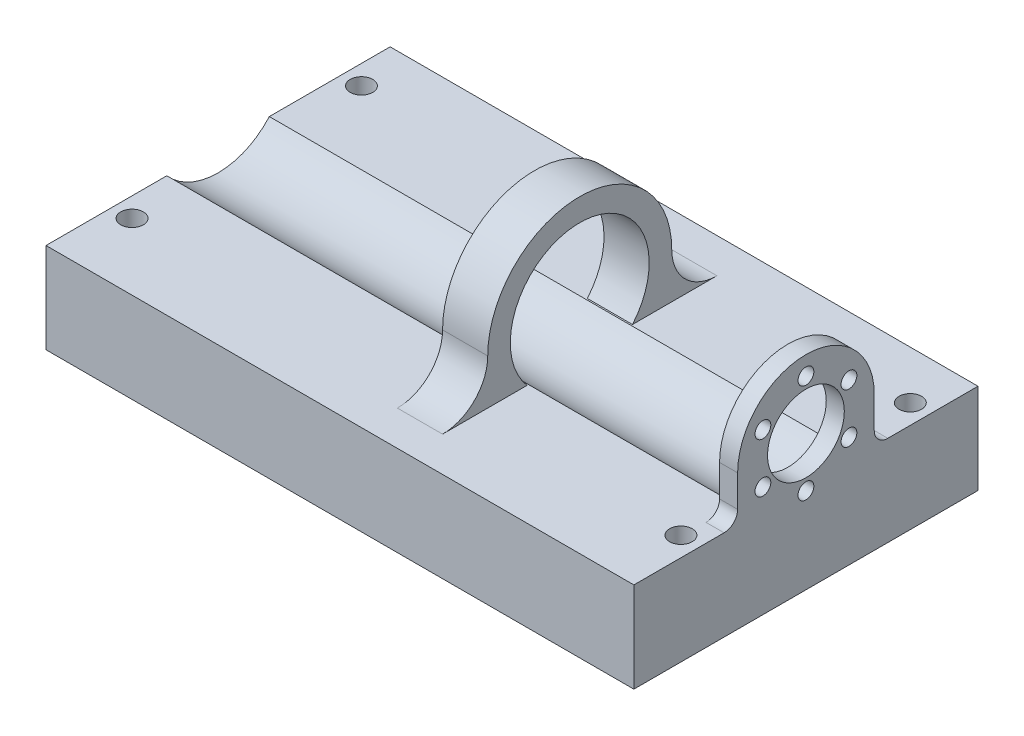
ISO-10303-21;
HEADER;
FILE_DESCRIPTION(('STEP AP214'),'2;1');
FILE_NAME('part.step','',(''),(''),'','','');
FILE_SCHEMA(('AUTOMOTIVE_DESIGN { 1 0 10303 214 1 1 1 1 }'));
ENDSEC;
DATA;
#1=APPLICATION_CONTEXT('core data for automotive mechanical design processes');
#2=APPLICATION_PROTOCOL_DEFINITION('international standard','automotive_design',2000,#1);
#3=PRODUCT_CONTEXT('',#1,'mechanical');
#4=PRODUCT('Part','Part','',(#3));
#5=PRODUCT_RELATED_PRODUCT_CATEGORY('part','',(#4));
#6=PRODUCT_DEFINITION_FORMATION('','',#4);
#7=PRODUCT_DEFINITION_CONTEXT('part definition',#1,'design');
#8=PRODUCT_DEFINITION('design','',#6,#7);
#9=PRODUCT_DEFINITION_SHAPE('','',#8);
#10=(LENGTH_UNIT() NAMED_UNIT(*) SI_UNIT(.MILLI.,.METRE.));
#11=(NAMED_UNIT(*) PLANE_ANGLE_UNIT() SI_UNIT($,.RADIAN.));
#12=(NAMED_UNIT(*) SI_UNIT($,.STERADIAN.) SOLID_ANGLE_UNIT());
#13=UNCERTAINTY_MEASURE_WITH_UNIT(LENGTH_MEASURE(1.E-05),#10,'distance_accuracy_value','');
#14=(GEOMETRIC_REPRESENTATION_CONTEXT(3) GLOBAL_UNCERTAINTY_ASSIGNED_CONTEXT((#13)) GLOBAL_UNIT_ASSIGNED_CONTEXT((#10,
#11,#12)) REPRESENTATION_CONTEXT('',''));
#15=CARTESIAN_POINT('',(0.,0.,0.));
#16=DIRECTION('',(0.,0.,1.));
#17=DIRECTION('',(1.,0.,0.));
#18=AXIS2_PLACEMENT_3D('',#15,#16,#17);
#19=CARTESIAN_POINT('',(0.,20.,0.));
#20=DIRECTION('',(0.,-1.,0.));
#21=DIRECTION('',(0.,0.,-1.));
#22=AXIS2_PLACEMENT_3D('',#19,#20,#21);
#23=PLANE('',#22);
#24=DIRECTION('',(0.,0.,-1.));
#25=VECTOR('',#24,1.);
#26=CARTESIAN_POINT('',(61.0875,20.,0.));
#27=LINE('',#26,#25);
#28=CARTESIAN_POINT('',(61.0875,20.,-11.3474942167864));
#29=VERTEX_POINT('',#28);
#30=CARTESIAN_POINT('',(61.0875,20.,-18.125));
#31=VERTEX_POINT('',#30);
#32=EDGE_CURVE('E237',#29,#31,#27,.T.);
#33=ORIENTED_EDGE('',*,*,#32,.T.);
#34=DIRECTION('',(1.,0.,0.));
#35=VECTOR('',#34,1.);
#36=CARTESIAN_POINT('',(65.0875,20.,-18.125));
#37=LINE('',#36,#35);
#38=CARTESIAN_POINT('',(65.0875,20.,-18.125));
#39=VERTEX_POINT('',#38);
#40=EDGE_CURVE('E211',#31,#39,#37,.T.);
#41=ORIENTED_EDGE('',*,*,#40,.T.);
#42=DIRECTION('',(0.,0.,-1.));
#43=VECTOR('',#42,1.);
#44=CARTESIAN_POINT('',(65.0875,20.,38.1));
#45=LINE('',#44,#43);
#46=CARTESIAN_POINT('',(65.0875,20.,-38.1));
#47=VERTEX_POINT('',#46);
#48=EDGE_CURVE('E246',#39,#47,#45,.T.);
#49=ORIENTED_EDGE('',*,*,#48,.T.);
#50=DIRECTION('',(-1.,0.,0.));
#51=VECTOR('',#50,1.);
#52=CARTESIAN_POINT('',(-65.0875,20.,-38.1));
#53=LINE('',#52,#51);
#54=CARTESIAN_POINT('',(-65.0875,20.,-38.1));
#55=VERTEX_POINT('',#54);
#56=EDGE_CURVE('E263',#47,#55,#53,.T.);
#57=ORIENTED_EDGE('',*,*,#56,.T.);
#58=DIRECTION('',(0.,0.,1.));
#59=VECTOR('',#58,1.);
#60=CARTESIAN_POINT('',(-65.0875,20.,38.1));
#61=LINE('',#60,#59);
#62=CARTESIAN_POINT('',(-65.0875,20.,-11.3474942167864));
#63=VERTEX_POINT('',#62);
#64=EDGE_CURVE('E273',#55,#63,#61,.T.);
#65=ORIENTED_EDGE('',*,*,#64,.T.);
#66=DIRECTION('',(1.,0.,0.));
#67=VECTOR('',#66,1.);
#68=CARTESIAN_POINT('',(-65.0875,20.,-11.3474942167864));
#69=LINE('',#68,#67);
#70=EDGE_CURVE('E305',#63,#29,#69,.T.);
#71=ORIENTED_EDGE('',*,*,#70,.T.);
#72=EDGE_LOOP('',(#33,#41,#49,#57,#65,#71));
#73=FACE_BOUND('',#72,.T.);
#74=CARTESIAN_POINT('',(-60.7695,20.,-27.432));
#75=DIRECTION('',(0.,-1.,0.));
#76=DIRECTION('',(0.,0.,-1.));
#77=AXIS2_PLACEMENT_3D('',#74,#75,#76);
#78=CIRCLE('',#77,2.50000000000001);
#79=CARTESIAN_POINT('',(-60.7695,20.,-29.932));
#80=VERTEX_POINT('',#79);
#81=EDGE_CURVE('E380',#80,#80,#78,.F.);
#82=ORIENTED_EDGE('',*,*,#81,.F.);
#83=EDGE_LOOP('',(#82));
#84=FACE_BOUND('',#83,.T.);
#85=CARTESIAN_POINT('',(60.7695,20.,-27.432));
#86=DIRECTION('',(0.,-1.,0.));
#87=DIRECTION('',(0.,0.,-1.));
#88=AXIS2_PLACEMENT_3D('',#85,#86,#87);
#89=CIRCLE('',#88,2.50000000000001);
#90=CARTESIAN_POINT('',(60.7695,20.,-29.932));
#91=VERTEX_POINT('',#90);
#92=EDGE_CURVE('E396',#91,#91,#89,.T.);
#93=ORIENTED_EDGE('',*,*,#92,.T.);
#94=EDGE_LOOP('',(#93));
#95=FACE_BOUND('',#94,.T.);
#96=DIRECTION('',(1.,0.,0.));
#97=VECTOR('',#96,1.);
#98=CARTESIAN_POINT('',(15.,20.,-30.375));
#99=LINE('',#98,#97);
#100=CARTESIAN_POINT('',(5.,20.,-30.375));
#101=VERTEX_POINT('',#100);
#102=CARTESIAN_POINT('',(15.,20.,-30.375));
#103=VERTEX_POINT('',#102);
#104=EDGE_CURVE('E196',#101,#103,#99,.T.);
#105=ORIENTED_EDGE('',*,*,#104,.T.);
#106=DIRECTION('',(0.,0.,-1.));
#107=VECTOR('',#106,1.);
#108=CARTESIAN_POINT('',(15.,20.,0.));
#109=LINE('',#108,#107);
#110=CARTESIAN_POINT('',(15.,20.,-11.6786396896214));
#111=VERTEX_POINT('',#110);
#112=EDGE_CURVE('E356',#111,#103,#109,.T.);
#113=ORIENTED_EDGE('',*,*,#112,.F.);
#114=DIRECTION('',(-1.,0.,0.));
#115=VECTOR('',#114,1.);
#116=CARTESIAN_POINT('',(15.,20.,-11.6786396896214));
#117=LINE('',#116,#115);
#118=CARTESIAN_POINT('',(5.,20.,-11.6786396896214));
#119=VERTEX_POINT('',#118);
#120=EDGE_CURVE('E372',#111,#119,#117,.T.);
#121=ORIENTED_EDGE('',*,*,#120,.T.);
#122=DIRECTION('',(0.,0.,-1.));
#123=VECTOR('',#122,1.);
#124=CARTESIAN_POINT('',(5.,20.,0.));
#125=LINE('',#124,#123);
#126=EDGE_CURVE('E181',#119,#101,#125,.T.);
#127=ORIENTED_EDGE('',*,*,#126,.T.);
#128=EDGE_LOOP('',(#105,#113,#121,#127));
#129=FACE_BOUND('',#128,.T.);
#130=ADVANCED_FACE('F41',(#73,#84,#95,#129),#23,.F.);
#131=CARTESIAN_POINT('',(65.0875,20.,38.1));
#132=VERTEX_POINT('',#131);
#133=CARTESIAN_POINT('',(65.0875,20.,18.125));
#134=VERTEX_POINT('',#133);
#135=EDGE_CURVE('E258',#132,#134,#45,.T.);
#136=ORIENTED_EDGE('',*,*,#135,.T.);
#137=DIRECTION('',(1.,0.,0.));
#138=VECTOR('',#137,1.);
#139=CARTESIAN_POINT('',(0.,20.,18.125));
#140=LINE('',#139,#138);
#141=CARTESIAN_POINT('',(61.0875,20.,18.125));
#142=VERTEX_POINT('',#141);
#143=EDGE_CURVE('E222',#134,#142,#140,.F.);
#144=ORIENTED_EDGE('',*,*,#143,.T.);
#145=DIRECTION('',(0.,0.,-1.));
#146=VECTOR('',#145,1.);
#147=CARTESIAN_POINT('',(61.0875,20.,0.));
#148=LINE('',#147,#146);
#149=CARTESIAN_POINT('',(61.0875,20.,11.3474942167864));
#150=VERTEX_POINT('',#149);
#151=EDGE_CURVE('E56',#142,#150,#148,.T.);
#152=ORIENTED_EDGE('',*,*,#151,.T.);
#153=DIRECTION('',(1.,0.,0.));
#154=VECTOR('',#153,1.);
#155=CARTESIAN_POINT('',(-65.0875,20.,11.3474942167864));
#156=LINE('',#155,#154);
#157=CARTESIAN_POINT('',(-65.0875,20.,11.3474942167864));
#158=VERTEX_POINT('',#157);
#159=EDGE_CURVE('E302',#150,#158,#156,.F.);
#160=ORIENTED_EDGE('',*,*,#159,.T.);
#161=CARTESIAN_POINT('',(-65.0875,20.,38.1));
#162=VERTEX_POINT('',#161);
#163=EDGE_CURVE('E272',#158,#162,#61,.T.);
#164=ORIENTED_EDGE('',*,*,#163,.T.);
#165=DIRECTION('',(1.,0.,0.));
#166=VECTOR('',#165,1.);
#167=CARTESIAN_POINT('',(-65.0875,20.,38.1));
#168=LINE('',#167,#166);
#169=EDGE_CURVE('E277',#162,#132,#168,.T.);
#170=ORIENTED_EDGE('',*,*,#169,.T.);
#171=EDGE_LOOP('',(#136,#144,#152,#160,#164,#170));
#172=FACE_BOUND('',#171,.T.);
#173=CARTESIAN_POINT('',(60.7695,20.,23.368));
#174=DIRECTION('',(0.,-1.,0.));
#175=DIRECTION('',(0.,0.,-1.));
#176=AXIS2_PLACEMENT_3D('',#173,#174,#175);
#177=CIRCLE('',#176,2.50000000000001);
#178=CARTESIAN_POINT('',(60.7695,20.,20.868));
#179=VERTEX_POINT('',#178);
#180=EDGE_CURVE('E403',#179,#179,#177,.T.);
#181=ORIENTED_EDGE('',*,*,#180,.T.);
#182=EDGE_LOOP('',(#181));
#183=FACE_BOUND('',#182,.T.);
#184=CARTESIAN_POINT('',(-60.7695,20.,23.368));
#185=DIRECTION('',(0.,-1.,0.));
#186=DIRECTION('',(0.,0.,-1.));
#187=AXIS2_PLACEMENT_3D('',#184,#185,#186);
#188=CIRCLE('',#187,2.50000000000001);
#189=CARTESIAN_POINT('',(-60.7695,20.,20.868));
#190=VERTEX_POINT('',#189);
#191=EDGE_CURVE('E387',#190,#190,#188,.F.);
#192=ORIENTED_EDGE('',*,*,#191,.F.);
#193=EDGE_LOOP('',(#192));
#194=FACE_BOUND('',#193,.T.);
#195=DIRECTION('',(0.,0.,1.));
#196=VECTOR('',#195,1.);
#197=CARTESIAN_POINT('',(15.,20.,0.));
#198=LINE('',#197,#196);
#199=CARTESIAN_POINT('',(15.,20.,11.6786396896214));
#200=VERTEX_POINT('',#199);
#201=CARTESIAN_POINT('',(15.,20.,30.375));
#202=VERTEX_POINT('',#201);
#203=EDGE_CURVE('E322',#200,#202,#198,.T.);
#204=ORIENTED_EDGE('',*,*,#203,.T.);
#205=DIRECTION('',(1.,0.,0.));
#206=VECTOR('',#205,1.);
#207=CARTESIAN_POINT('',(0.,20.,30.375));
#208=LINE('',#207,#206);
#209=CARTESIAN_POINT('',(5.,20.,30.375));
#210=VERTEX_POINT('',#209);
#211=EDGE_CURVE('E205',#202,#210,#208,.F.);
#212=ORIENTED_EDGE('',*,*,#211,.T.);
#213=DIRECTION('',(0.,0.,1.));
#214=VECTOR('',#213,1.);
#215=CARTESIAN_POINT('',(5.,20.,0.));
#216=LINE('',#215,#214);
#217=CARTESIAN_POINT('',(5.,20.,11.6786396896214));
#218=VERTEX_POINT('',#217);
#219=EDGE_CURVE('E180',#218,#210,#216,.T.);
#220=ORIENTED_EDGE('',*,*,#219,.F.);
#221=DIRECTION('',(-1.,0.,0.));
#222=VECTOR('',#221,1.);
#223=CARTESIAN_POINT('',(15.,20.,11.6786396896214));
#224=LINE('',#223,#222);
#225=EDGE_CURVE('E363',#200,#218,#224,.T.);
#226=ORIENTED_EDGE('',*,*,#225,.F.);
#227=EDGE_LOOP('',(#204,#212,#220,#226));
#228=FACE_BOUND('',#227,.T.);
#229=ADVANCED_FACE('F319',(#172,#183,#194,#228),#23,.F.);
#230=CARTESIAN_POINT('',(15.,30.,0.));
#231=DIRECTION('',(-1.,0.,0.));
#232=DIRECTION('',(0.,0.,1.));
#233=AXIS2_PLACEMENT_3D('',#230,#231,#232);
#234=CYLINDRICAL_SURFACE('',#233,20.375);
#235=CARTESIAN_POINT('',(15.,30.,0.));
#236=DIRECTION('',(1.,0.,0.));
#237=DIRECTION('',(0.,0.,-1.));
#238=AXIS2_PLACEMENT_3D('',#235,#236,#237);
#239=CIRCLE('',#238,20.375);
#240=CARTESIAN_POINT('',(15.,30.,-20.375));
#241=VERTEX_POINT('',#240);
#242=CARTESIAN_POINT('',(15.,30.0000000000014,20.375));
#243=VERTEX_POINT('',#242);
#244=EDGE_CURVE('E188',#241,#243,#239,.T.);
#245=ORIENTED_EDGE('',*,*,#244,.F.);
#246=DIRECTION('',(1.,0.,0.));
#247=VECTOR('',#246,1.);
#248=CARTESIAN_POINT('',(-5.33823373993176,30.,-20.375));
#249=LINE('',#248,#247);
#250=CARTESIAN_POINT('',(5.,30.,-20.375));
#251=VERTEX_POINT('',#250);
#252=EDGE_CURVE('E185',#251,#241,#249,.T.);
#253=ORIENTED_EDGE('',*,*,#252,.F.);
#254=CARTESIAN_POINT('',(5.,30.,0.));
#255=DIRECTION('',(1.,0.,0.));
#256=DIRECTION('',(0.,0.,-1.));
#257=AXIS2_PLACEMENT_3D('',#254,#255,#256);
#258=CIRCLE('',#257,20.375);
#259=CARTESIAN_POINT('',(5.,30.0000000000014,20.375));
#260=VERTEX_POINT('',#259);
#261=EDGE_CURVE('E166',#251,#260,#258,.T.);
#262=ORIENTED_EDGE('',*,*,#261,.T.);
#263=DIRECTION('',(1.,0.,0.));
#264=VECTOR('',#263,1.);
#265=CARTESIAN_POINT('',(-5.33823373993176,29.9999999999999,20.375));
#266=LINE('',#265,#264);
#267=EDGE_CURVE('E192',#260,#243,#266,.T.);
#268=ORIENTED_EDGE('',*,*,#267,.T.);
#269=EDGE_LOOP('',(#245,#253,#262,#268));
#270=FACE_BOUND('',#269,.T.);
#271=ADVANCED_FACE('F186',(#270),#234,.T.);
#272=CARTESIAN_POINT('',(61.0875,30.,0.));
#273=DIRECTION('',(1.,0.,0.));
#274=DIRECTION('',(0.,0.,-1.));
#275=AXIS2_PLACEMENT_3D('',#272,#273,#274);
#276=CYLINDRICAL_SURFACE('',#275,15.125);
#277=CARTESIAN_POINT('',(65.0875,30.,0.));
#278=DIRECTION('',(1.,0.,0.));
#279=DIRECTION('',(0.,0.,-1.));
#280=AXIS2_PLACEMENT_3D('',#277,#278,#279);
#281=CIRCLE('',#280,15.125);
#282=CARTESIAN_POINT('',(65.0875,30.,-15.125));
#283=VERTEX_POINT('',#282);
#284=CARTESIAN_POINT('',(65.0875,30.,15.125));
#285=VERTEX_POINT('',#284);
#286=EDGE_CURVE('E454',#283,#285,#281,.T.);
#287=ORIENTED_EDGE('',*,*,#286,.F.);
#288=DIRECTION('',(1.,0.,0.));
#289=VECTOR('',#288,1.);
#290=CARTESIAN_POINT('',(50.3978063681781,30.,-15.125));
#291=LINE('',#290,#289);
#292=CARTESIAN_POINT('',(61.0875,30.,-15.125));
#293=VERTEX_POINT('',#292);
#294=EDGE_CURVE('E329',#293,#283,#291,.T.);
#295=ORIENTED_EDGE('',*,*,#294,.F.);
#296=CARTESIAN_POINT('',(61.0875,30.,0.));
#297=DIRECTION('',(1.,0.,0.));
#298=DIRECTION('',(0.,0.,-1.));
#299=AXIS2_PLACEMENT_3D('',#296,#297,#298);
#300=CIRCLE('',#299,15.125);
#301=CARTESIAN_POINT('',(61.0875,30.,15.125));
#302=VERTEX_POINT('',#301);
#303=EDGE_CURVE('E460',#293,#302,#300,.T.);
#304=ORIENTED_EDGE('',*,*,#303,.T.);
#305=DIRECTION('',(1.,0.,0.));
#306=VECTOR('',#305,1.);
#307=CARTESIAN_POINT('',(50.3978063681781,30.,15.125));
#308=LINE('',#307,#306);
#309=EDGE_CURVE('E343',#302,#285,#308,.T.);
#310=ORIENTED_EDGE('',*,*,#309,.T.);
#311=EDGE_LOOP('',(#287,#295,#304,#310));
#312=FACE_BOUND('',#311,.T.);
#313=ADVANCED_FACE('F467',(#312),#276,.T.);
#314=CARTESIAN_POINT('',(-65.0875,30.,0.));
#315=DIRECTION('',(1.,0.,0.));
#316=DIRECTION('',(0.,0.,-1.));
#317=AXIS2_PLACEMENT_3D('',#314,#315,#316);
#318=CYLINDRICAL_SURFACE('',#317,15.125);
#319=EDGE_CURVE('E458',#150,#29,#300,.T.);
#320=ORIENTED_EDGE('',*,*,#319,.T.);
#321=ORIENTED_EDGE('',*,*,#70,.F.);
#322=CARTESIAN_POINT('',(-65.0875,30.,0.));
#323=DIRECTION('',(1.,0.,0.));
#324=DIRECTION('',(0.,0.,-1.));
#325=AXIS2_PLACEMENT_3D('',#322,#323,#324);
#326=CIRCLE('',#325,15.125);
#327=EDGE_CURVE('E268',#158,#63,#326,.T.);
#328=ORIENTED_EDGE('',*,*,#327,.F.);
#329=ORIENTED_EDGE('',*,*,#159,.F.);
#330=EDGE_LOOP('',(#320,#321,#328,#329));
#331=FACE_BOUND('',#330,.T.);
#332=ADVANCED_FACE('F499',(#331),#318,.F.);
#333=CARTESIAN_POINT('',(65.0875,20.,38.1));
#334=DIRECTION('',(-1.,0.,0.));
#335=DIRECTION('',(0.,0.,1.));
#336=AXIS2_PLACEMENT_3D('',#333,#334,#335);
#337=PLANE('',#336);
#338=ORIENTED_EDGE('',*,*,#48,.F.);
#339=CARTESIAN_POINT('',(65.0875,23.,-18.125));
#340=DIRECTION('',(-1.,0.,0.));
#341=DIRECTION('',(0.,0.,1.));
#342=AXIS2_PLACEMENT_3D('',#339,#340,#341);
#343=CIRCLE('',#342,3.);
#344=CARTESIAN_POINT('',(65.0875,23.,-15.125));
#345=VERTEX_POINT('',#344);
#346=EDGE_CURVE('E225',#39,#345,#343,.T.);
#347=ORIENTED_EDGE('',*,*,#346,.T.);
#348=DIRECTION('',(0.,-1.,0.));
#349=VECTOR('',#348,1.);
#350=CARTESIAN_POINT('',(65.0875,0.,-15.125));
#351=LINE('',#350,#349);
#352=EDGE_CURVE('E326',#283,#345,#351,.T.);
#353=ORIENTED_EDGE('',*,*,#352,.F.);
#354=ORIENTED_EDGE('',*,*,#286,.T.);
#355=DIRECTION('',(0.,-1.,0.));
#356=VECTOR('',#355,1.);
#357=CARTESIAN_POINT('',(65.0875,0.,15.125));
#358=LINE('',#357,#356);
#359=CARTESIAN_POINT('',(65.0875,23.,15.125));
#360=VERTEX_POINT('',#359);
#361=EDGE_CURVE('E335',#285,#360,#358,.T.);
#362=ORIENTED_EDGE('',*,*,#361,.T.);
#363=CARTESIAN_POINT('',(65.0875,23.,18.125));
#364=DIRECTION('',(-1.,0.,0.));
#365=DIRECTION('',(0.,0.,1.));
#366=AXIS2_PLACEMENT_3D('',#363,#364,#365);
#367=CIRCLE('',#366,3.);
#368=EDGE_CURVE('E50',#360,#134,#367,.T.);
#369=ORIENTED_EDGE('',*,*,#368,.T.);
#370=ORIENTED_EDGE('',*,*,#135,.F.);
#371=DIRECTION('',(0.,-1.,0.));
#372=VECTOR('',#371,1.);
#373=CARTESIAN_POINT('',(65.0875,20.,38.1));
#374=LINE('',#373,#372);
#375=CARTESIAN_POINT('',(65.0875,0.,38.1));
#376=VERTEX_POINT('',#375);
#377=EDGE_CURVE('E280',#132,#376,#374,.T.);
#378=ORIENTED_EDGE('',*,*,#377,.T.);
#379=DIRECTION('',(0.,0.,-1.));
#380=VECTOR('',#379,1.);
#381=CARTESIAN_POINT('',(65.0875,0.,38.1));
#382=LINE('',#381,#380);
#383=CARTESIAN_POINT('',(65.0875,0.,-38.1));
#384=VERTEX_POINT('',#383);
#385=EDGE_CURVE('E281',#376,#384,#382,.T.);
#386=ORIENTED_EDGE('',*,*,#385,.T.);
#387=DIRECTION('',(0.,-1.,0.));
#388=VECTOR('',#387,1.);
#389=CARTESIAN_POINT('',(65.0875,20.,-38.1));
#390=LINE('',#389,#388);
#391=EDGE_CURVE('E256',#47,#384,#390,.T.);
#392=ORIENTED_EDGE('',*,*,#391,.F.);
#393=EDGE_LOOP('',(#338,#347,#353,#354,#362,#369,#370,#378,#386,#392));
#394=FACE_BOUND('',#393,.T.);
#395=CARTESIAN_POINT('',(65.0875,30.,0.));
#396=DIRECTION('',(1.,0.,0.));
#397=DIRECTION('',(0.,0.,-1.));
#398=AXIS2_PLACEMENT_3D('',#395,#396,#397);
#399=CIRCLE('',#398,8.5);
#400=CARTESIAN_POINT('',(65.0875,30.,-8.5));
#401=VERTEX_POINT('',#400);
#402=EDGE_CURVE('E313',#401,#401,#399,.T.);
#403=ORIENTED_EDGE('',*,*,#402,.F.);
#404=EDGE_LOOP('',(#403));
#405=FACE_BOUND('',#404,.T.);
#406=CARTESIAN_POINT('',(65.0875,35.5000000000001,-9.52627944162876));
#407=DIRECTION('',(-1.,0.,0.));
#408=DIRECTION('',(0.,0.866025403784433,0.50000000000001));
#409=AXIS2_PLACEMENT_3D('',#406,#407,#408);
#410=CIRCLE('',#409,1.75);
#411=CARTESIAN_POINT('',(65.0875,37.0155444566229,-8.65127944162874));
#412=VERTEX_POINT('',#411);
#413=EDGE_CURVE('E312',#412,#412,#410,.T.);
#414=ORIENTED_EDGE('',*,*,#413,.T.);
#415=EDGE_LOOP('',(#414));
#416=FACE_BOUND('',#415,.T.);
#417=CARTESIAN_POINT('',(65.0875,24.5000000000001,-9.52627944162888));
#418=DIRECTION('',(-1.,0.,0.));
#419=DIRECTION('',(0.,0.866025403784443,-0.499999999999992));
#420=AXIS2_PLACEMENT_3D('',#417,#418,#419);
#421=CIRCLE('',#420,1.75);
#422=CARTESIAN_POINT('',(65.0875,26.0155444566229,-10.4012794416289));
#423=VERTEX_POINT('',#422);
#424=EDGE_CURVE('E428',#423,#423,#421,.T.);
#425=ORIENTED_EDGE('',*,*,#424,.T.);
#426=EDGE_LOOP('',(#425));
#427=FACE_BOUND('',#426,.T.);
#428=CARTESIAN_POINT('',(65.0875,19.,0.));
#429=DIRECTION('',(-1.,0.,0.));
#430=DIRECTION('',(0.,0.,-1.));
#431=AXIS2_PLACEMENT_3D('',#428,#429,#430);
#432=CIRCLE('',#431,1.75);
#433=CARTESIAN_POINT('',(65.0875,19.,-1.75));
#434=VERTEX_POINT('',#433);
#435=EDGE_CURVE('E420',#434,#434,#432,.T.);
#436=ORIENTED_EDGE('',*,*,#435,.T.);
#437=EDGE_LOOP('',(#436));
#438=FACE_BOUND('',#437,.T.);
#439=CARTESIAN_POINT('',(65.0875,24.5,9.52627944162881));
#440=DIRECTION('',(-1.,0.,0.));
#441=DIRECTION('',(0.,-0.866025403784436,-0.500000000000004));
#442=AXIS2_PLACEMENT_3D('',#439,#440,#441);
#443=CIRCLE('',#442,1.75);
#444=CARTESIAN_POINT('',(65.0875,22.9844555433772,8.6512794416288));
#445=VERTEX_POINT('',#444);
#446=EDGE_CURVE('E410',#445,#445,#443,.T.);
#447=ORIENTED_EDGE('',*,*,#446,.T.);
#448=EDGE_LOOP('',(#447));
#449=FACE_BOUND('',#448,.T.);
#450=CARTESIAN_POINT('',(65.0875,35.5,9.52627944162884));
#451=DIRECTION('',(-1.,0.,0.));
#452=DIRECTION('',(0.,-0.86602540378444,0.499999999999998));
#453=AXIS2_PLACEMENT_3D('',#450,#451,#452);
#454=CIRCLE('',#453,1.75);
#455=CARTESIAN_POINT('',(65.0875,33.9844555433772,10.4012794416288));
#456=VERTEX_POINT('',#455);
#457=EDGE_CURVE('E419',#456,#456,#454,.T.);
#458=ORIENTED_EDGE('',*,*,#457,.T.);
#459=EDGE_LOOP('',(#458));
#460=FACE_BOUND('',#459,.T.);
#461=CARTESIAN_POINT('',(65.0875,41.,0.));
#462=DIRECTION('',(-1.,0.,0.));
#463=DIRECTION('',(0.,0.,1.));
#464=AXIS2_PLACEMENT_3D('',#461,#462,#463);
#465=CIRCLE('',#464,1.75);
#466=CARTESIAN_POINT('',(65.0875,41.,1.75));
#467=VERTEX_POINT('',#466);
#468=EDGE_CURVE('E450',#467,#467,#465,.T.);
#469=ORIENTED_EDGE('',*,*,#468,.T.);
#470=EDGE_LOOP('',(#469));
#471=FACE_BOUND('',#470,.T.);
#472=ADVANCED_FACE('F250',(#394,#405,#416,#427,#438,#449,#460,#471),#337,.F.);
#473=CARTESIAN_POINT('',(-65.0875,20.,-38.1));
#474=DIRECTION('',(0.,0.,1.));
#475=DIRECTION('',(1.,0.,0.));
#476=AXIS2_PLACEMENT_3D('',#473,#474,#475);
#477=PLANE('',#476);
#478=DIRECTION('',(-1.,0.,0.));
#479=VECTOR('',#478,1.);
#480=CARTESIAN_POINT('',(-65.0875,0.,-38.1));
#481=LINE('',#480,#479);
#482=CARTESIAN_POINT('',(-65.0875,0.,-38.1));
#483=VERTEX_POINT('',#482);
#484=EDGE_CURVE('E284',#384,#483,#481,.T.);
#485=ORIENTED_EDGE('',*,*,#484,.T.);
#486=DIRECTION('',(0.,-1.,0.));
#487=VECTOR('',#486,1.);
#488=CARTESIAN_POINT('',(-65.0875,20.,-38.1));
#489=LINE('',#488,#487);
#490=EDGE_CURVE('E296',#55,#483,#489,.T.);
#491=ORIENTED_EDGE('',*,*,#490,.F.);
#492=ORIENTED_EDGE('',*,*,#56,.F.);
#493=ORIENTED_EDGE('',*,*,#391,.T.);
#494=EDGE_LOOP('',(#485,#491,#492,#493));
#495=FACE_BOUND('',#494,.T.);
#496=ADVANCED_FACE('F488',(#495),#477,.F.);
#497=CARTESIAN_POINT('',(-65.0875,20.,38.1));
#498=DIRECTION('',(1.,0.,0.));
#499=DIRECTION('',(0.,0.,-1.));
#500=AXIS2_PLACEMENT_3D('',#497,#498,#499);
#501=PLANE('',#500);
#502=ORIENTED_EDGE('',*,*,#163,.F.);
#503=ORIENTED_EDGE('',*,*,#327,.T.);
#504=ORIENTED_EDGE('',*,*,#64,.F.);
#505=ORIENTED_EDGE('',*,*,#490,.T.);
#506=DIRECTION('',(0.,0.,1.));
#507=VECTOR('',#506,1.);
#508=CARTESIAN_POINT('',(-65.0875,0.,38.1));
#509=LINE('',#508,#507);
#510=CARTESIAN_POINT('',(-65.0875,0.,38.1));
#511=VERTEX_POINT('',#510);
#512=EDGE_CURVE('E264',#483,#511,#509,.T.);
#513=ORIENTED_EDGE('',*,*,#512,.T.);
#514=DIRECTION('',(0.,-1.,0.));
#515=VECTOR('',#514,1.);
#516=CARTESIAN_POINT('',(-65.0875,20.,38.1));
#517=LINE('',#516,#515);
#518=EDGE_CURVE('E292',#162,#511,#517,.T.);
#519=ORIENTED_EDGE('',*,*,#518,.F.);
#520=EDGE_LOOP('',(#502,#503,#504,#505,#513,#519));
#521=FACE_BOUND('',#520,.T.);
#522=ADVANCED_FACE('F493',(#521),#501,.F.);
#523=CARTESIAN_POINT('',(-65.0875,20.,38.1));
#524=DIRECTION('',(0.,0.,-1.));
#525=DIRECTION('',(-1.,0.,0.));
#526=AXIS2_PLACEMENT_3D('',#523,#524,#525);
#527=PLANE('',#526);
#528=DIRECTION('',(1.,0.,0.));
#529=VECTOR('',#528,1.);
#530=CARTESIAN_POINT('',(-65.0875,0.,38.1));
#531=LINE('',#530,#529);
#532=EDGE_CURVE('E259',#511,#376,#531,.T.);
#533=ORIENTED_EDGE('',*,*,#532,.T.);
#534=ORIENTED_EDGE('',*,*,#377,.F.);
#535=ORIENTED_EDGE('',*,*,#169,.F.);
#536=ORIENTED_EDGE('',*,*,#518,.T.);
#537=EDGE_LOOP('',(#533,#534,#535,#536));
#538=FACE_BOUND('',#537,.T.);
#539=ADVANCED_FACE('F501',(#538),#527,.F.);
#540=CARTESIAN_POINT('',(0.,0.,0.));
#541=DIRECTION('',(0.,-1.,0.));
#542=DIRECTION('',(0.,0.,-1.));
#543=AXIS2_PLACEMENT_3D('',#540,#541,#542);
#544=PLANE('',#543);
#545=CARTESIAN_POINT('',(-60.7695,0.,23.368));
#546=DIRECTION('',(0.,1.,0.));
#547=DIRECTION('',(0.,0.,-1.));
#548=AXIS2_PLACEMENT_3D('',#545,#546,#547);
#549=CIRCLE('',#548,2.50000000000001);
#550=CARTESIAN_POINT('',(-60.7695,0.,20.868));
#551=VERTEX_POINT('',#550);
#552=EDGE_CURVE('E376',#551,#551,#549,.T.);
#553=ORIENTED_EDGE('',*,*,#552,.T.);
#554=EDGE_LOOP('',(#553));
#555=FACE_BOUND('',#554,.T.);
#556=CARTESIAN_POINT('',(-60.7695,0.,-27.432));
#557=DIRECTION('',(0.,1.,0.));
#558=DIRECTION('',(0.,0.,-1.));
#559=AXIS2_PLACEMENT_3D('',#556,#557,#558);
#560=CIRCLE('',#559,2.50000000000001);
#561=CARTESIAN_POINT('',(-60.7695,0.,-29.932));
#562=VERTEX_POINT('',#561);
#563=EDGE_CURVE('E375',#562,#562,#560,.T.);
#564=ORIENTED_EDGE('',*,*,#563,.T.);
#565=EDGE_LOOP('',(#564));
#566=FACE_BOUND('',#565,.T.);
#567=CARTESIAN_POINT('',(60.7695,0.,23.368));
#568=DIRECTION('',(0.,-1.,0.));
#569=DIRECTION('',(0.,0.,-1.));
#570=AXIS2_PLACEMENT_3D('',#567,#568,#569);
#571=CIRCLE('',#570,2.50000000000001);
#572=CARTESIAN_POINT('',(60.7695,0.,20.868));
#573=VERTEX_POINT('',#572);
#574=EDGE_CURVE('E392',#573,#573,#571,.T.);
#575=ORIENTED_EDGE('',*,*,#574,.F.);
#576=EDGE_LOOP('',(#575));
#577=FACE_BOUND('',#576,.T.);
#578=CARTESIAN_POINT('',(60.7695,0.,-27.432));
#579=DIRECTION('',(0.,-1.,0.));
#580=DIRECTION('',(0.,0.,-1.));
#581=AXIS2_PLACEMENT_3D('',#578,#579,#580);
#582=CIRCLE('',#581,2.50000000000001);
#583=CARTESIAN_POINT('',(60.7695,0.,-29.932));
#584=VERTEX_POINT('',#583);
#585=EDGE_CURVE('E391',#584,#584,#582,.T.);
#586=ORIENTED_EDGE('',*,*,#585,.F.);
#587=EDGE_LOOP('',(#586));
#588=FACE_BOUND('',#587,.T.);
#589=ORIENTED_EDGE('',*,*,#385,.F.);
#590=ORIENTED_EDGE('',*,*,#532,.F.);
#591=ORIENTED_EDGE('',*,*,#512,.F.);
#592=ORIENTED_EDGE('',*,*,#484,.F.);
#593=EDGE_LOOP('',(#589,#590,#591,#592));
#594=FACE_BOUND('',#593,.T.);
#595=ADVANCED_FACE('F484',(#555,#566,#577,#588,#594),#544,.T.);
#596=CARTESIAN_POINT('',(61.0875,30.,0.));
#597=DIRECTION('',(1.,0.,0.));
#598=DIRECTION('',(0.,0.,-1.));
#599=AXIS2_PLACEMENT_3D('',#596,#597,#598);
#600=PLANE('',#599);
#601=CARTESIAN_POINT('',(61.0875,30.,0.));
#602=DIRECTION('',(1.,0.,0.));
#603=DIRECTION('',(0.,0.,-1.));
#604=AXIS2_PLACEMENT_3D('',#601,#602,#603);
#605=CIRCLE('',#604,8.5);
#606=CARTESIAN_POINT('',(61.0875,30.,-8.5));
#607=VERTEX_POINT('',#606);
#608=EDGE_CURVE('E308',#607,#607,#605,.T.);
#609=ORIENTED_EDGE('',*,*,#608,.T.);
#610=EDGE_LOOP('',(#609));
#611=FACE_BOUND('',#610,.T.);
#612=CARTESIAN_POINT('',(61.0875,35.5000000000001,-9.52627944162876));
#613=DIRECTION('',(-1.,0.,0.));
#614=DIRECTION('',(0.,0.866025403784433,0.50000000000001));
#615=AXIS2_PLACEMENT_3D('',#612,#613,#614);
#616=CIRCLE('',#615,1.75);
#617=CARTESIAN_POINT('',(61.0875,37.0155444566229,-8.65127944162874));
#618=VERTEX_POINT('',#617);
#619=EDGE_CURVE('E432',#618,#618,#616,.T.);
#620=ORIENTED_EDGE('',*,*,#619,.F.);
#621=EDGE_LOOP('',(#620));
#622=FACE_BOUND('',#621,.T.);
#623=CARTESIAN_POINT('',(61.0875,24.5000000000001,-9.52627944162888));
#624=DIRECTION('',(-1.,0.,0.));
#625=DIRECTION('',(0.,0.866025403784443,-0.499999999999992));
#626=AXIS2_PLACEMENT_3D('',#623,#624,#625);
#627=CIRCLE('',#626,1.75);
#628=CARTESIAN_POINT('',(61.0875,26.0155444566229,-10.4012794416289));
#629=VERTEX_POINT('',#628);
#630=EDGE_CURVE('E424',#629,#629,#627,.T.);
#631=ORIENTED_EDGE('',*,*,#630,.F.);
#632=EDGE_LOOP('',(#631));
#633=FACE_BOUND('',#632,.T.);
#634=CARTESIAN_POINT('',(61.0875,19.,0.));
#635=DIRECTION('',(-1.,0.,0.));
#636=DIRECTION('',(0.,0.,-1.));
#637=AXIS2_PLACEMENT_3D('',#634,#635,#636);
#638=CIRCLE('',#637,1.75);
#639=CARTESIAN_POINT('',(61.0875,19.,-1.75));
#640=VERTEX_POINT('',#639);
#641=EDGE_CURVE('E415',#640,#640,#638,.T.);
#642=ORIENTED_EDGE('',*,*,#641,.F.);
#643=EDGE_LOOP('',(#642));
#644=FACE_BOUND('',#643,.T.);
#645=CARTESIAN_POINT('',(61.0875,24.5,9.52627944162881));
#646=DIRECTION('',(-1.,0.,0.));
#647=DIRECTION('',(0.,-0.866025403784436,-0.500000000000004));
#648=AXIS2_PLACEMENT_3D('',#645,#646,#647);
#649=CIRCLE('',#648,1.75);
#650=CARTESIAN_POINT('',(61.0875,22.9844555433772,8.6512794416288));
#651=VERTEX_POINT('',#650);
#652=EDGE_CURVE('E414',#651,#651,#649,.T.);
#653=ORIENTED_EDGE('',*,*,#652,.F.);
#654=EDGE_LOOP('',(#653));
#655=FACE_BOUND('',#654,.T.);
#656=CARTESIAN_POINT('',(61.0875,35.5,9.52627944162884));
#657=DIRECTION('',(-1.,0.,0.));
#658=DIRECTION('',(0.,-0.86602540378444,0.499999999999998));
#659=AXIS2_PLACEMENT_3D('',#656,#657,#658);
#660=CIRCLE('',#659,1.75);
#661=CARTESIAN_POINT('',(61.0875,33.9844555433772,10.4012794416288));
#662=VERTEX_POINT('',#661);
#663=EDGE_CURVE('E445',#662,#662,#660,.T.);
#664=ORIENTED_EDGE('',*,*,#663,.F.);
#665=EDGE_LOOP('',(#664));
#666=FACE_BOUND('',#665,.T.);
#667=CARTESIAN_POINT('',(61.0875,41.,0.));
#668=DIRECTION('',(-1.,0.,0.));
#669=DIRECTION('',(0.,0.,1.));
#670=AXIS2_PLACEMENT_3D('',#667,#668,#669);
#671=CIRCLE('',#670,1.75);
#672=CARTESIAN_POINT('',(61.0875,41.,1.75));
#673=VERTEX_POINT('',#672);
#674=EDGE_CURVE('E449',#673,#673,#671,.T.);
#675=ORIENTED_EDGE('',*,*,#674,.F.);
#676=EDGE_LOOP('',(#675));
#677=FACE_BOUND('',#676,.T.);
#678=ORIENTED_EDGE('',*,*,#319,.F.);
#679=ORIENTED_EDGE('',*,*,#151,.F.);
#680=CARTESIAN_POINT('',(61.0875,23.,18.125));
#681=DIRECTION('',(1.,0.,0.));
#682=DIRECTION('',(0.,0.,-1.));
#683=AXIS2_PLACEMENT_3D('',#680,#681,#682);
#684=CIRCLE('',#683,3.);
#685=CARTESIAN_POINT('',(61.0875,23.,15.125));
#686=VERTEX_POINT('',#685);
#687=EDGE_CURVE('E11',#142,#686,#684,.T.);
#688=ORIENTED_EDGE('',*,*,#687,.T.);
#689=DIRECTION('',(0.,1.,0.));
#690=VECTOR('',#689,1.);
#691=CARTESIAN_POINT('',(61.0875,0.,15.125));
#692=LINE('',#691,#690);
#693=EDGE_CURVE('E342',#686,#302,#692,.T.);
#694=ORIENTED_EDGE('',*,*,#693,.T.);
#695=ORIENTED_EDGE('',*,*,#303,.F.);
#696=DIRECTION('',(0.,1.,0.));
#697=VECTOR('',#696,1.);
#698=CARTESIAN_POINT('',(61.0875,0.,-15.125));
#699=LINE('',#698,#697);
#700=CARTESIAN_POINT('',(61.0875,23.,-15.125));
#701=VERTEX_POINT('',#700);
#702=EDGE_CURVE('E239',#701,#293,#699,.T.);
#703=ORIENTED_EDGE('',*,*,#702,.F.);
#704=CARTESIAN_POINT('',(61.0875,23.,-18.125));
#705=DIRECTION('',(1.,0.,0.));
#706=DIRECTION('',(0.,0.,-1.));
#707=AXIS2_PLACEMENT_3D('',#704,#705,#706);
#708=CIRCLE('',#707,3.);
#709=EDGE_CURVE('E228',#701,#31,#708,.T.);
#710=ORIENTED_EDGE('',*,*,#709,.T.);
#711=ORIENTED_EDGE('',*,*,#32,.F.);
#712=EDGE_LOOP('',(#678,#679,#688,#694,#695,#703,#710,#711));
#713=FACE_BOUND('',#712,.T.);
#714=ADVANCED_FACE('F236',(#611,#622,#633,#644,#655,#666,#677,#713),#600,.F.);
#715=CARTESIAN_POINT('',(65.0875,41.,0.));
#716=DIRECTION('',(-1.,0.,0.));
#717=DIRECTION('',(0.,0.,1.));
#718=AXIS2_PLACEMENT_3D('',#715,#716,#717);
#719=CYLINDRICAL_SURFACE('',#718,1.75);
#720=ORIENTED_EDGE('',*,*,#468,.F.);
#721=EDGE_LOOP('',(#720));
#722=FACE_BOUND('',#721,.T.);
#723=ORIENTED_EDGE('',*,*,#674,.T.);
#724=EDGE_LOOP('',(#723));
#725=FACE_BOUND('',#724,.T.);
#726=ADVANCED_FACE('F523',(#722,#725),#719,.F.);
#727=CARTESIAN_POINT('',(65.0875,35.5,9.52627944162884));
#728=DIRECTION('',(-1.,0.,0.));
#729=DIRECTION('',(0.,-0.86602540378444,0.499999999999998));
#730=AXIS2_PLACEMENT_3D('',#727,#728,#729);
#731=CYLINDRICAL_SURFACE('',#730,1.75);
#732=ORIENTED_EDGE('',*,*,#457,.F.);
#733=EDGE_LOOP('',(#732));
#734=FACE_BOUND('',#733,.T.);
#735=ORIENTED_EDGE('',*,*,#663,.T.);
#736=EDGE_LOOP('',(#735));
#737=FACE_BOUND('',#736,.T.);
#738=ADVANCED_FACE('F527',(#734,#737),#731,.F.);
#739=CARTESIAN_POINT('',(65.0875,24.5,9.52627944162881));
#740=DIRECTION('',(-1.,0.,0.));
#741=DIRECTION('',(0.,-0.866025403784436,-0.500000000000004));
#742=AXIS2_PLACEMENT_3D('',#739,#740,#741);
#743=CYLINDRICAL_SURFACE('',#742,1.75);
#744=ORIENTED_EDGE('',*,*,#446,.F.);
#745=EDGE_LOOP('',(#744));
#746=FACE_BOUND('',#745,.T.);
#747=ORIENTED_EDGE('',*,*,#652,.T.);
#748=EDGE_LOOP('',(#747));
#749=FACE_BOUND('',#748,.T.);
#750=ADVANCED_FACE('F531',(#746,#749),#743,.F.);
#751=CARTESIAN_POINT('',(65.0875,19.,0.));
#752=DIRECTION('',(-1.,0.,0.));
#753=DIRECTION('',(0.,0.,-1.));
#754=AXIS2_PLACEMENT_3D('',#751,#752,#753);
#755=CYLINDRICAL_SURFACE('',#754,1.75);
#756=ORIENTED_EDGE('',*,*,#435,.F.);
#757=EDGE_LOOP('',(#756));
#758=FACE_BOUND('',#757,.T.);
#759=ORIENTED_EDGE('',*,*,#641,.T.);
#760=EDGE_LOOP('',(#759));
#761=FACE_BOUND('',#760,.T.);
#762=ADVANCED_FACE('F541',(#758,#761),#755,.F.);
#763=CARTESIAN_POINT('',(65.0875,24.5000000000001,-9.52627944162888));
#764=DIRECTION('',(-1.,0.,0.));
#765=DIRECTION('',(0.,0.866025403784443,-0.499999999999992));
#766=AXIS2_PLACEMENT_3D('',#763,#764,#765);
#767=CYLINDRICAL_SURFACE('',#766,1.75);
#768=ORIENTED_EDGE('',*,*,#424,.F.);
#769=EDGE_LOOP('',(#768));
#770=FACE_BOUND('',#769,.T.);
#771=ORIENTED_EDGE('',*,*,#630,.T.);
#772=EDGE_LOOP('',(#771));
#773=FACE_BOUND('',#772,.T.);
#774=ADVANCED_FACE('F537',(#770,#773),#767,.F.);
#775=CARTESIAN_POINT('',(65.0875,35.5000000000001,-9.52627944162876));
#776=DIRECTION('',(-1.,0.,0.));
#777=DIRECTION('',(0.,0.866025403784433,0.50000000000001));
#778=AXIS2_PLACEMENT_3D('',#775,#776,#777);
#779=CYLINDRICAL_SURFACE('',#778,1.75);
#780=ORIENTED_EDGE('',*,*,#413,.F.);
#781=EDGE_LOOP('',(#780));
#782=FACE_BOUND('',#781,.T.);
#783=ORIENTED_EDGE('',*,*,#619,.T.);
#784=EDGE_LOOP('',(#783));
#785=FACE_BOUND('',#784,.T.);
#786=ADVANCED_FACE('F533',(#782,#785),#779,.F.);
#787=CARTESIAN_POINT('',(-65.0875,30.,0.));
#788=DIRECTION('',(1.,0.,0.));
#789=DIRECTION('',(0.,0.,-1.));
#790=AXIS2_PLACEMENT_3D('',#787,#788,#789);
#791=CYLINDRICAL_SURFACE('',#790,8.5);
#792=ORIENTED_EDGE('',*,*,#402,.T.);
#793=EDGE_LOOP('',(#792));
#794=FACE_BOUND('',#793,.T.);
#795=ORIENTED_EDGE('',*,*,#608,.F.);
#796=EDGE_LOOP('',(#795));
#797=FACE_BOUND('',#796,.T.);
#798=ADVANCED_FACE('F536',(#794,#797),#791,.F.);
#799=CARTESIAN_POINT('',(60.7695,45.125,-27.432));
#800=DIRECTION('',(0.,-1.,0.));
#801=DIRECTION('',(0.,0.,-1.));
#802=AXIS2_PLACEMENT_3D('',#799,#800,#801);
#803=CYLINDRICAL_SURFACE('',#802,2.50000000000001);
#804=ORIENTED_EDGE('',*,*,#585,.T.);
#805=EDGE_LOOP('',(#804));
#806=FACE_BOUND('',#805,.T.);
#807=ORIENTED_EDGE('',*,*,#92,.F.);
#808=EDGE_LOOP('',(#807));
#809=FACE_BOUND('',#808,.T.);
#810=ADVANCED_FACE('F551',(#806,#809),#803,.F.);
#811=CARTESIAN_POINT('',(60.7695,45.125,23.368));
#812=DIRECTION('',(0.,-1.,0.));
#813=DIRECTION('',(0.,0.,-1.));
#814=AXIS2_PLACEMENT_3D('',#811,#812,#813);
#815=CYLINDRICAL_SURFACE('',#814,2.50000000000001);
#816=ORIENTED_EDGE('',*,*,#574,.T.);
#817=EDGE_LOOP('',(#816));
#818=FACE_BOUND('',#817,.T.);
#819=ORIENTED_EDGE('',*,*,#180,.F.);
#820=EDGE_LOOP('',(#819));
#821=FACE_BOUND('',#820,.T.);
#822=ADVANCED_FACE('F555',(#818,#821),#815,.F.);
#823=CARTESIAN_POINT('',(-60.7695,45.125,-27.432));
#824=DIRECTION('',(0.,-1.,0.));
#825=DIRECTION('',(0.,0.,-1.));
#826=AXIS2_PLACEMENT_3D('',#823,#824,#825);
#827=CYLINDRICAL_SURFACE('',#826,2.50000000000001);
#828=ORIENTED_EDGE('',*,*,#563,.F.);
#829=EDGE_LOOP('',(#828));
#830=FACE_BOUND('',#829,.T.);
#831=ORIENTED_EDGE('',*,*,#81,.T.);
#832=EDGE_LOOP('',(#831));
#833=FACE_BOUND('',#832,.T.);
#834=ADVANCED_FACE('F559',(#830,#833),#827,.F.);
#835=CARTESIAN_POINT('',(-60.7695,45.125,23.368));
#836=DIRECTION('',(0.,-1.,0.));
#837=DIRECTION('',(0.,0.,-1.));
#838=AXIS2_PLACEMENT_3D('',#835,#836,#837);
#839=CYLINDRICAL_SURFACE('',#838,2.50000000000001);
#840=ORIENTED_EDGE('',*,*,#552,.F.);
#841=EDGE_LOOP('',(#840));
#842=FACE_BOUND('',#841,.T.);
#843=ORIENTED_EDGE('',*,*,#191,.T.);
#844=EDGE_LOOP('',(#843));
#845=FACE_BOUND('',#844,.T.);
#846=ADVANCED_FACE('F563',(#842,#845),#839,.F.);
#847=CARTESIAN_POINT('',(15.,30.,0.));
#848=DIRECTION('',(-1.,0.,0.));
#849=DIRECTION('',(0.,0.,1.));
#850=AXIS2_PLACEMENT_3D('',#847,#848,#849);
#851=CYLINDRICAL_SURFACE('',#850,15.375);
#852=CARTESIAN_POINT('',(5.,30.,0.));
#853=DIRECTION('',(1.,0.,0.));
#854=DIRECTION('',(0.,0.,-1.));
#855=AXIS2_PLACEMENT_3D('',#852,#853,#854);
#856=CIRCLE('',#855,15.375);
#857=EDGE_CURVE('E351',#119,#218,#856,.T.);
#858=ORIENTED_EDGE('',*,*,#857,.F.);
#859=ORIENTED_EDGE('',*,*,#120,.F.);
#860=CARTESIAN_POINT('',(15.,30.,0.));
#861=DIRECTION('',(1.,0.,0.));
#862=DIRECTION('',(0.,0.,-1.));
#863=AXIS2_PLACEMENT_3D('',#860,#861,#862);
#864=CIRCLE('',#863,15.375);
#865=EDGE_CURVE('E352',#111,#200,#864,.T.);
#866=ORIENTED_EDGE('',*,*,#865,.T.);
#867=ORIENTED_EDGE('',*,*,#225,.T.);
#868=EDGE_LOOP('',(#858,#859,#866,#867));
#869=FACE_BOUND('',#868,.T.);
#870=ADVANCED_FACE('F567',(#869),#851,.F.);
#871=CARTESIAN_POINT('',(15.,0.,0.));
#872=DIRECTION('',(1.,0.,0.));
#873=DIRECTION('',(0.,0.,-1.));
#874=AXIS2_PLACEMENT_3D('',#871,#872,#873);
#875=PLANE('',#874);
#876=ORIENTED_EDGE('',*,*,#865,.F.);
#877=ORIENTED_EDGE('',*,*,#112,.T.);
#878=CARTESIAN_POINT('',(15.,30.,-30.375));
#879=DIRECTION('',(1.,0.,0.));
#880=DIRECTION('',(0.,0.,-1.));
#881=AXIS2_PLACEMENT_3D('',#878,#879,#880);
#882=CIRCLE('',#881,10.);
#883=EDGE_CURVE('E199',#103,#241,#882,.F.);
#884=ORIENTED_EDGE('',*,*,#883,.T.);
#885=ORIENTED_EDGE('',*,*,#244,.T.);
#886=CARTESIAN_POINT('',(15.,30.,30.375));
#887=DIRECTION('',(1.,0.,0.));
#888=DIRECTION('',(0.,0.,-1.));
#889=AXIS2_PLACEMENT_3D('',#886,#887,#888);
#890=CIRCLE('',#889,10.);
#891=EDGE_CURVE('E198',#243,#202,#890,.F.);
#892=ORIENTED_EDGE('',*,*,#891,.T.);
#893=ORIENTED_EDGE('',*,*,#203,.F.);
#894=EDGE_LOOP('',(#876,#877,#884,#885,#892,#893));
#895=FACE_BOUND('',#894,.T.);
#896=ADVANCED_FACE('F571',(#895),#875,.T.);
#897=CARTESIAN_POINT('',(5.,0.,0.));
#898=DIRECTION('',(1.,0.,0.));
#899=DIRECTION('',(0.,0.,-1.));
#900=AXIS2_PLACEMENT_3D('',#897,#898,#899);
#901=PLANE('',#900);
#902=ORIENTED_EDGE('',*,*,#857,.T.);
#903=ORIENTED_EDGE('',*,*,#219,.T.);
#904=CARTESIAN_POINT('',(5.,30.,30.375));
#905=DIRECTION('',(1.,0.,0.));
#906=DIRECTION('',(0.,0.,-1.));
#907=AXIS2_PLACEMENT_3D('',#904,#905,#906);
#908=CIRCLE('',#907,10.);
#909=EDGE_CURVE('E175',#210,#260,#908,.T.);
#910=ORIENTED_EDGE('',*,*,#909,.T.);
#911=ORIENTED_EDGE('',*,*,#261,.F.);
#912=CARTESIAN_POINT('',(5.,30.,-30.375));
#913=DIRECTION('',(1.,0.,0.));
#914=DIRECTION('',(0.,0.,-1.));
#915=AXIS2_PLACEMENT_3D('',#912,#913,#914);
#916=CIRCLE('',#915,10.);
#917=EDGE_CURVE('E172',#251,#101,#916,.T.);
#918=ORIENTED_EDGE('',*,*,#917,.T.);
#919=ORIENTED_EDGE('',*,*,#126,.F.);
#920=EDGE_LOOP('',(#902,#903,#910,#911,#918,#919));
#921=FACE_BOUND('',#920,.T.);
#922=ADVANCED_FACE('F169',(#921),#901,.F.);
#923=CARTESIAN_POINT('',(50.3978063681781,0.,15.125));
#924=DIRECTION('',(0.,0.,1.));
#925=DIRECTION('',(1.,0.,0.));
#926=AXIS2_PLACEMENT_3D('',#923,#924,#925);
#927=PLANE('',#926);
#928=ORIENTED_EDGE('',*,*,#693,.F.);
#929=DIRECTION('',(1.,0.,0.));
#930=VECTOR('',#929,1.);
#931=CARTESIAN_POINT('',(50.3978063681781,23.,15.125));
#932=LINE('',#931,#930);
#933=EDGE_CURVE('E218',#686,#360,#932,.T.);
#934=ORIENTED_EDGE('',*,*,#933,.T.);
#935=ORIENTED_EDGE('',*,*,#361,.F.);
#936=ORIENTED_EDGE('',*,*,#309,.F.);
#937=EDGE_LOOP('',(#928,#934,#935,#936));
#938=FACE_BOUND('',#937,.T.);
#939=ADVANCED_FACE('F471',(#938),#927,.T.);
#940=CARTESIAN_POINT('',(50.3978063681781,0.,-15.125));
#941=DIRECTION('',(0.,0.,1.));
#942=DIRECTION('',(1.,0.,0.));
#943=AXIS2_PLACEMENT_3D('',#940,#941,#942);
#944=PLANE('',#943);
#945=ORIENTED_EDGE('',*,*,#352,.T.);
#946=DIRECTION('',(1.,0.,0.));
#947=VECTOR('',#946,1.);
#948=CARTESIAN_POINT('',(61.0875,23.,-15.125));
#949=LINE('',#948,#947);
#950=EDGE_CURVE('E215',#345,#701,#949,.F.);
#951=ORIENTED_EDGE('',*,*,#950,.T.);
#952=ORIENTED_EDGE('',*,*,#702,.T.);
#953=ORIENTED_EDGE('',*,*,#294,.T.);
#954=EDGE_LOOP('',(#945,#951,#952,#953));
#955=FACE_BOUND('',#954,.T.);
#956=ADVANCED_FACE('F582',(#955),#944,.F.);
#957=CARTESIAN_POINT('',(0.,30.,-30.375));
#958=DIRECTION('',(-1.,0.,0.));
#959=DIRECTION('',(0.,0.,1.));
#960=AXIS2_PLACEMENT_3D('',#957,#958,#959);
#961=CYLINDRICAL_SURFACE('',#960,10.);
#962=ORIENTED_EDGE('',*,*,#917,.F.);
#963=ORIENTED_EDGE('',*,*,#252,.T.);
#964=ORIENTED_EDGE('',*,*,#883,.F.);
#965=ORIENTED_EDGE('',*,*,#104,.F.);
#966=EDGE_LOOP('',(#962,#963,#964,#965));
#967=FACE_BOUND('',#966,.T.);
#968=ADVANCED_FACE('F194',(#967),#961,.F.);
#969=CARTESIAN_POINT('',(-5.33823373993176,30.,30.375));
#970=DIRECTION('',(1.,0.,0.));
#971=DIRECTION('',(0.,0.,-1.));
#972=AXIS2_PLACEMENT_3D('',#969,#970,#971);
#973=CYLINDRICAL_SURFACE('',#972,10.);
#974=ORIENTED_EDGE('',*,*,#909,.F.);
#975=ORIENTED_EDGE('',*,*,#211,.F.);
#976=ORIENTED_EDGE('',*,*,#891,.F.);
#977=ORIENTED_EDGE('',*,*,#267,.F.);
#978=EDGE_LOOP('',(#974,#975,#976,#977));
#979=FACE_BOUND('',#978,.T.);
#980=ADVANCED_FACE('F324',(#979),#973,.F.);
#981=CARTESIAN_POINT('',(0.,23.,-18.125));
#982=DIRECTION('',(-1.,0.,0.));
#983=DIRECTION('',(0.,0.,1.));
#984=AXIS2_PLACEMENT_3D('',#981,#982,#983);
#985=CYLINDRICAL_SURFACE('',#984,3.);
#986=ORIENTED_EDGE('',*,*,#709,.F.);
#987=ORIENTED_EDGE('',*,*,#950,.F.);
#988=ORIENTED_EDGE('',*,*,#346,.F.);
#989=ORIENTED_EDGE('',*,*,#40,.F.);
#990=EDGE_LOOP('',(#986,#987,#988,#989));
#991=FACE_BOUND('',#990,.T.);
#992=ADVANCED_FACE('F242',(#991),#985,.F.);
#993=CARTESIAN_POINT('',(50.3978063681781,23.,18.125));
#994=DIRECTION('',(1.,0.,0.));
#995=DIRECTION('',(0.,0.,-1.));
#996=AXIS2_PLACEMENT_3D('',#993,#994,#995);
#997=CYLINDRICAL_SURFACE('',#996,3.);
#998=ORIENTED_EDGE('',*,*,#687,.F.);
#999=ORIENTED_EDGE('',*,*,#143,.F.);
#1000=ORIENTED_EDGE('',*,*,#368,.F.);
#1001=ORIENTED_EDGE('',*,*,#933,.F.);
#1002=EDGE_LOOP('',(#998,#999,#1000,#1001));
#1003=FACE_BOUND('',#1002,.T.);
#1004=ADVANCED_FACE('F43',(#1003),#997,.F.);
#1005=CLOSED_SHELL('',(#130,#229,#271,#313,#332,#472,#496,#522,#539,#595,#714,#726,#738,#750,
#762,#774,#786,#798,#810,#822,#834,#846,#870,#896,#922,#939,#956,#968,#980,#992,#1004));
#1006=MANIFOLD_SOLID_BREP('B2',#1005);
#1007=ADVANCED_BREP_SHAPE_REPRESENTATION('',(#18,#1006),#14);
#1008=SHAPE_DEFINITION_REPRESENTATION(#9,#1007);
ENDSEC;
END-ISO-10303-21;
